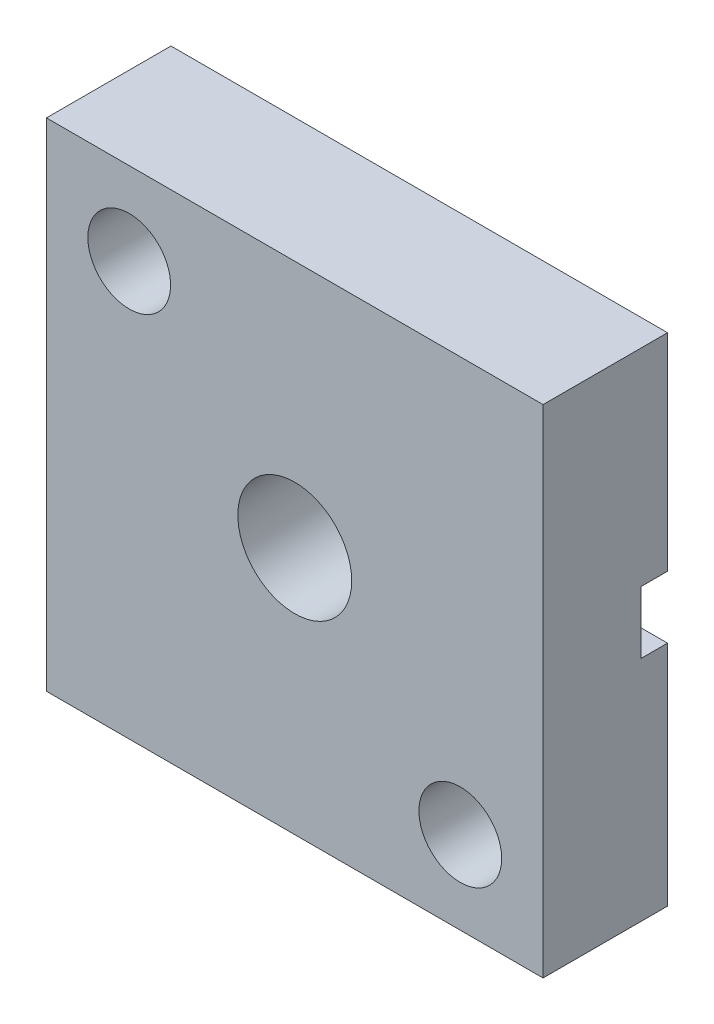
ISO-10303-21;
HEADER;
FILE_DESCRIPTION(('STEP AP214'),'2;1');
FILE_NAME('part.step','',(''),(''),'','','');
FILE_SCHEMA(('AUTOMOTIVE_DESIGN { 1 0 10303 214 1 1 1 1 }'));
ENDSEC;
DATA;
#1=APPLICATION_CONTEXT('core data for automotive mechanical design processes');
#2=APPLICATION_PROTOCOL_DEFINITION('international standard','automotive_design',2000,#1);
#3=PRODUCT_CONTEXT('',#1,'mechanical');
#4=PRODUCT('Part','Part','',(#3));
#5=PRODUCT_RELATED_PRODUCT_CATEGORY('part','',(#4));
#6=PRODUCT_DEFINITION_FORMATION('','',#4);
#7=PRODUCT_DEFINITION_CONTEXT('part definition',#1,'design');
#8=PRODUCT_DEFINITION('design','',#6,#7);
#9=PRODUCT_DEFINITION_SHAPE('','',#8);
#10=(LENGTH_UNIT() NAMED_UNIT(*) SI_UNIT(.MILLI.,.METRE.));
#11=(NAMED_UNIT(*) PLANE_ANGLE_UNIT() SI_UNIT($,.RADIAN.));
#12=(NAMED_UNIT(*) SI_UNIT($,.STERADIAN.) SOLID_ANGLE_UNIT());
#13=UNCERTAINTY_MEASURE_WITH_UNIT(LENGTH_MEASURE(1.E-05),#10,'distance_accuracy_value','');
#14=(GEOMETRIC_REPRESENTATION_CONTEXT(3) GLOBAL_UNCERTAINTY_ASSIGNED_CONTEXT((#13)) GLOBAL_UNIT_ASSIGNED_CONTEXT((#10,
#11,#12)) REPRESENTATION_CONTEXT('',''));
#15=CARTESIAN_POINT('',(0.,0.,0.));
#16=DIRECTION('',(0.,0.,1.));
#17=DIRECTION('',(1.,0.,0.));
#18=AXIS2_PLACEMENT_3D('',#15,#16,#17);
#19=CARTESIAN_POINT('',(-141.382958107723,-76.1974665146765,0.));
#20=DIRECTION('',(0.,0.,-1.));
#21=DIRECTION('',(-1.,0.,0.));
#22=AXIS2_PLACEMENT_3D('',#19,#20,#21);
#23=PLANE('',#22);
#24=DIRECTION('',(-1.,0.,0.));
#25=VECTOR('',#24,1.);
#26=CARTESIAN_POINT('',(-122.332958107723,-86.5098665146765,0.));
#27=LINE('',#26,#25);
#28=CARTESIAN_POINT('',(-122.332958107723,-86.5098665146765,0.));
#29=VERTEX_POINT('',#28);
#30=CARTESIAN_POINT('',(-129.820409433458,-86.5098665146765,0.));
#31=VERTEX_POINT('',#30);
#32=EDGE_CURVE('E152',#29,#31,#27,.T.);
#33=ORIENTED_EDGE('',*,*,#32,.F.);
#34=DIRECTION('',(0.,1.,0.));
#35=VECTOR('',#34,1.);
#36=CARTESIAN_POINT('',(-122.332958107723,-95.2474665146765,0.));
#37=LINE('',#36,#35);
#38=CARTESIAN_POINT('',(-122.332958107723,-95.2474665146765,0.));
#39=VERTEX_POINT('',#38);
#40=EDGE_CURVE('E141',#39,#29,#37,.T.);
#41=ORIENTED_EDGE('',*,*,#40,.F.);
#42=DIRECTION('',(1.,0.,0.));
#43=VECTOR('',#42,1.);
#44=CARTESIAN_POINT('',(-141.382958107723,-95.2474665146765,0.));
#45=LINE('',#44,#43);
#46=CARTESIAN_POINT('',(-141.382958107723,-95.2474665146765,0.));
#47=VERTEX_POINT('',#46);
#48=EDGE_CURVE('E194',#47,#39,#45,.T.);
#49=ORIENTED_EDGE('',*,*,#48,.F.);
#50=DIRECTION('',(0.,-1.,0.));
#51=VECTOR('',#50,1.);
#52=CARTESIAN_POINT('',(-141.382958107723,-95.2474665146765,0.));
#53=LINE('',#52,#51);
#54=CARTESIAN_POINT('',(-141.382958107723,-86.5098665146765,0.));
#55=VERTEX_POINT('',#54);
#56=EDGE_CURVE('E176',#55,#47,#53,.T.);
#57=ORIENTED_EDGE('',*,*,#56,.F.);
#58=CARTESIAN_POINT('',(-133.895506781988,-86.5098665146765,0.));
#59=VERTEX_POINT('',#58);
#60=EDGE_CURVE('E155',#59,#55,#27,.T.);
#61=ORIENTED_EDGE('',*,*,#60,.F.);
#62=CARTESIAN_POINT('',(-131.857958107723,-85.7224665146766,0.));
#63=DIRECTION('',(0.,0.,1.));
#64=DIRECTION('',(1.,0.,0.));
#65=AXIS2_PLACEMENT_3D('',#62,#63,#64);
#66=CIRCLE('',#65,2.1844);
#67=EDGE_CURVE('E177',#59,#31,#66,.T.);
#68=ORIENTED_EDGE('',*,*,#67,.T.);
#69=EDGE_LOOP('',(#33,#41,#49,#57,#61,#68));
#70=FACE_BOUND('',#69,.T.);
#71=CARTESIAN_POINT('',(-125.507958107723,-92.0724665146765,0.));
#72=DIRECTION('',(0.,0.,1.));
#73=DIRECTION('',(1.,0.,0.));
#74=AXIS2_PLACEMENT_3D('',#71,#72,#73);
#75=CIRCLE('',#74,1.5875);
#76=CARTESIAN_POINT('',(-123.920458107723,-92.0724665146765,0.));
#77=VERTEX_POINT('',#76);
#78=EDGE_CURVE('E167',#77,#77,#75,.T.);
#79=ORIENTED_EDGE('',*,*,#78,.T.);
#80=EDGE_LOOP('',(#79));
#81=FACE_BOUND('',#80,.T.);
#82=ADVANCED_FACE('F31',(#70,#81),#23,.T.);
#83=CARTESIAN_POINT('',(-141.382958107723,-95.2474665146765,4.7752));
#84=DIRECTION('',(1.,0.,0.));
#85=DIRECTION('',(0.,0.,-1.));
#86=AXIS2_PLACEMENT_3D('',#83,#84,#85);
#87=PLANE('',#86);
#88=DIRECTION('',(0.,1.,0.));
#89=VECTOR('',#88,1.);
#90=CARTESIAN_POINT('',(-141.382958107723,-84.1222665146765,1.016));
#91=LINE('',#90,#89);
#92=CARTESIAN_POINT('',(-141.382958107723,-86.5098665146765,1.016));
#93=VERTEX_POINT('',#92);
#94=CARTESIAN_POINT('',(-141.382958107723,-84.1222665146765,1.016));
#95=VERTEX_POINT('',#94);
#96=EDGE_CURVE('E144',#93,#95,#91,.T.);
#97=ORIENTED_EDGE('',*,*,#96,.F.);
#98=DIRECTION('',(0.,0.,1.));
#99=VECTOR('',#98,1.);
#100=CARTESIAN_POINT('',(-141.382958107723,-86.5098665146765,0.));
#101=LINE('',#100,#99);
#102=EDGE_CURVE('E148',#55,#93,#101,.T.);
#103=ORIENTED_EDGE('',*,*,#102,.F.);
#104=ORIENTED_EDGE('',*,*,#56,.T.);
#105=DIRECTION('',(0.,0.,-1.));
#106=VECTOR('',#105,1.);
#107=CARTESIAN_POINT('',(-141.382958107723,-95.2474665146765,4.7752));
#108=LINE('',#107,#106);
#109=CARTESIAN_POINT('',(-141.382958107723,-95.2474665146765,4.7752));
#110=VERTEX_POINT('',#109);
#111=EDGE_CURVE('E206',#110,#47,#108,.T.);
#112=ORIENTED_EDGE('',*,*,#111,.F.);
#113=DIRECTION('',(0.,-1.,0.));
#114=VECTOR('',#113,1.);
#115=CARTESIAN_POINT('',(-141.382958107723,-95.2474665146765,4.7752));
#116=LINE('',#115,#114);
#117=CARTESIAN_POINT('',(-141.382958107723,-76.1974665146765,4.7752));
#118=VERTEX_POINT('',#117);
#119=EDGE_CURVE('E180',#118,#110,#116,.T.);
#120=ORIENTED_EDGE('',*,*,#119,.F.);
#121=DIRECTION('',(0.,0.,-1.));
#122=VECTOR('',#121,1.);
#123=CARTESIAN_POINT('',(-141.382958107723,-76.1974665146765,4.7752));
#124=LINE('',#123,#122);
#125=CARTESIAN_POINT('',(-141.382958107723,-76.1974665146765,0.));
#126=VERTEX_POINT('',#125);
#127=EDGE_CURVE('E190',#118,#126,#124,.T.);
#128=ORIENTED_EDGE('',*,*,#127,.T.);
#129=CARTESIAN_POINT('',(-141.382958107723,-84.1222665146765,0.));
#130=VERTEX_POINT('',#129);
#131=EDGE_CURVE('E191',#126,#130,#53,.T.);
#132=ORIENTED_EDGE('',*,*,#131,.T.);
#133=DIRECTION('',(0.,0.,-1.));
#134=VECTOR('',#133,1.);
#135=CARTESIAN_POINT('',(-141.382958107723,-84.1222665146765,0.));
#136=LINE('',#135,#134);
#137=EDGE_CURVE('E142',#95,#130,#136,.T.);
#138=ORIENTED_EDGE('',*,*,#137,.F.);
#139=EDGE_LOOP('',(#97,#103,#104,#112,#120,#128,#132,#138));
#140=FACE_BOUND('',#139,.T.);
#141=ADVANCED_FACE('F33',(#140),#87,.F.);
#142=CARTESIAN_POINT('',(-141.382958107723,-95.2474665146765,4.7752));
#143=DIRECTION('',(0.,1.,0.));
#144=DIRECTION('',(0.,0.,1.));
#145=AXIS2_PLACEMENT_3D('',#142,#143,#144);
#146=PLANE('',#145);
#147=ORIENTED_EDGE('',*,*,#48,.T.);
#148=DIRECTION('',(0.,0.,-1.));
#149=VECTOR('',#148,1.);
#150=CARTESIAN_POINT('',(-122.332958107723,-95.2474665146765,4.7752));
#151=LINE('',#150,#149);
#152=CARTESIAN_POINT('',(-122.332958107723,-95.2474665146765,4.7752));
#153=VERTEX_POINT('',#152);
#154=EDGE_CURVE('E204',#153,#39,#151,.T.);
#155=ORIENTED_EDGE('',*,*,#154,.F.);
#156=DIRECTION('',(1.,0.,0.));
#157=VECTOR('',#156,1.);
#158=CARTESIAN_POINT('',(-141.382958107723,-95.2474665146765,4.7752));
#159=LINE('',#158,#157);
#160=EDGE_CURVE('E183',#110,#153,#159,.T.);
#161=ORIENTED_EDGE('',*,*,#160,.F.);
#162=ORIENTED_EDGE('',*,*,#111,.T.);
#163=EDGE_LOOP('',(#147,#155,#161,#162));
#164=FACE_BOUND('',#163,.T.);
#165=ADVANCED_FACE('F259',(#164),#146,.F.);
#166=CARTESIAN_POINT('',(-122.332958107723,-95.2474665146765,4.7752));
#167=DIRECTION('',(-1.,0.,0.));
#168=DIRECTION('',(0.,0.,1.));
#169=AXIS2_PLACEMENT_3D('',#166,#167,#168);
#170=PLANE('',#169);
#171=ORIENTED_EDGE('',*,*,#40,.T.);
#172=DIRECTION('',(0.,0.,1.));
#173=VECTOR('',#172,1.);
#174=CARTESIAN_POINT('',(-122.332958107723,-86.5098665146765,0.));
#175=LINE('',#174,#173);
#176=CARTESIAN_POINT('',(-122.332958107723,-86.5098665146765,1.016));
#177=VERTEX_POINT('',#176);
#178=EDGE_CURVE('E120',#29,#177,#175,.T.);
#179=ORIENTED_EDGE('',*,*,#178,.T.);
#180=DIRECTION('',(0.,1.,0.));
#181=VECTOR('',#180,1.);
#182=CARTESIAN_POINT('',(-122.332958107723,-84.1222665146765,1.016));
#183=LINE('',#182,#181);
#184=CARTESIAN_POINT('',(-122.332958107723,-84.1222665146765,1.016));
#185=VERTEX_POINT('',#184);
#186=EDGE_CURVE('E128',#177,#185,#183,.T.);
#187=ORIENTED_EDGE('',*,*,#186,.T.);
#188=DIRECTION('',(0.,0.,-1.));
#189=VECTOR('',#188,1.);
#190=CARTESIAN_POINT('',(-122.332958107723,-84.1222665146765,0.));
#191=LINE('',#190,#189);
#192=CARTESIAN_POINT('',(-122.332958107723,-84.1222665146765,0.));
#193=VERTEX_POINT('',#192);
#194=EDGE_CURVE('E135',#185,#193,#191,.T.);
#195=ORIENTED_EDGE('',*,*,#194,.T.);
#196=CARTESIAN_POINT('',(-122.332958107723,-76.1974665146765,0.));
#197=VERTEX_POINT('',#196);
#198=EDGE_CURVE('E196',#193,#197,#37,.T.);
#199=ORIENTED_EDGE('',*,*,#198,.T.);
#200=DIRECTION('',(0.,0.,-1.));
#201=VECTOR('',#200,1.);
#202=CARTESIAN_POINT('',(-122.332958107723,-76.1974665146765,4.7752));
#203=LINE('',#202,#201);
#204=CARTESIAN_POINT('',(-122.332958107723,-76.1974665146765,4.7752));
#205=VERTEX_POINT('',#204);
#206=EDGE_CURVE('E201',#205,#197,#203,.T.);
#207=ORIENTED_EDGE('',*,*,#206,.F.);
#208=DIRECTION('',(0.,1.,0.));
#209=VECTOR('',#208,1.);
#210=CARTESIAN_POINT('',(-122.332958107723,-95.2474665146765,4.7752));
#211=LINE('',#210,#209);
#212=EDGE_CURVE('E186',#153,#205,#211,.T.);
#213=ORIENTED_EDGE('',*,*,#212,.F.);
#214=ORIENTED_EDGE('',*,*,#154,.T.);
#215=EDGE_LOOP('',(#171,#179,#187,#195,#199,#207,#213,#214));
#216=FACE_BOUND('',#215,.T.);
#217=ADVANCED_FACE('F138',(#216),#170,.F.);
#218=CARTESIAN_POINT('',(-141.382958107723,-76.1974665146765,4.7752));
#219=DIRECTION('',(0.,-1.,0.));
#220=DIRECTION('',(0.,0.,-1.));
#221=AXIS2_PLACEMENT_3D('',#218,#219,#220);
#222=PLANE('',#221);
#223=DIRECTION('',(-1.,0.,0.));
#224=VECTOR('',#223,1.);
#225=CARTESIAN_POINT('',(-141.382958107723,-76.1974665146765,0.));
#226=LINE('',#225,#224);
#227=EDGE_CURVE('E184',#197,#126,#226,.T.);
#228=ORIENTED_EDGE('',*,*,#227,.T.);
#229=ORIENTED_EDGE('',*,*,#127,.F.);
#230=DIRECTION('',(-1.,0.,0.));
#231=VECTOR('',#230,1.);
#232=CARTESIAN_POINT('',(-141.382958107723,-76.1974665146765,4.7752));
#233=LINE('',#232,#231);
#234=EDGE_CURVE('E188',#205,#118,#233,.T.);
#235=ORIENTED_EDGE('',*,*,#234,.F.);
#236=ORIENTED_EDGE('',*,*,#206,.T.);
#237=EDGE_LOOP('',(#228,#229,#235,#236));
#238=FACE_BOUND('',#237,.T.);
#239=ADVANCED_FACE('F246',(#238),#222,.F.);
#240=CARTESIAN_POINT('',(-141.382958107723,-76.1974665146765,4.7752));
#241=DIRECTION('',(0.,0.,-1.));
#242=DIRECTION('',(-1.,0.,0.));
#243=AXIS2_PLACEMENT_3D('',#240,#241,#242);
#244=PLANE('',#243);
#245=CARTESIAN_POINT('',(-138.207958107723,-79.3724665146765,4.7752));
#246=DIRECTION('',(0.,0.,1.));
#247=DIRECTION('',(-1.,0.,0.));
#248=AXIS2_PLACEMENT_3D('',#245,#246,#247);
#249=CIRCLE('',#248,1.58750000000002);
#250=CARTESIAN_POINT('',(-139.795458107723,-79.3724665146765,4.7752));
#251=VERTEX_POINT('',#250);
#252=EDGE_CURVE('E154',#251,#251,#249,.T.);
#253=ORIENTED_EDGE('',*,*,#252,.F.);
#254=EDGE_LOOP('',(#253));
#255=FACE_BOUND('',#254,.T.);
#256=CARTESIAN_POINT('',(-125.507958107723,-92.0724665146765,4.7752));
#257=DIRECTION('',(0.,0.,1.));
#258=DIRECTION('',(1.,0.,0.));
#259=AXIS2_PLACEMENT_3D('',#256,#257,#258);
#260=CIRCLE('',#259,1.5875);
#261=CARTESIAN_POINT('',(-123.920458107723,-92.0724665146765,4.7752));
#262=VERTEX_POINT('',#261);
#263=EDGE_CURVE('E164',#262,#262,#260,.T.);
#264=ORIENTED_EDGE('',*,*,#263,.F.);
#265=EDGE_LOOP('',(#264));
#266=FACE_BOUND('',#265,.T.);
#267=CARTESIAN_POINT('',(-131.857958107723,-85.7224665146766,4.7752));
#268=DIRECTION('',(0.,0.,1.));
#269=DIRECTION('',(1.,0.,0.));
#270=AXIS2_PLACEMENT_3D('',#267,#268,#269);
#271=CIRCLE('',#270,2.1844);
#272=CARTESIAN_POINT('',(-129.673558107723,-85.7224665146766,4.7752));
#273=VERTEX_POINT('',#272);
#274=EDGE_CURVE('E170',#273,#273,#271,.T.);
#275=ORIENTED_EDGE('',*,*,#274,.F.);
#276=EDGE_LOOP('',(#275));
#277=FACE_BOUND('',#276,.T.);
#278=ORIENTED_EDGE('',*,*,#119,.T.);
#279=ORIENTED_EDGE('',*,*,#160,.T.);
#280=ORIENTED_EDGE('',*,*,#212,.T.);
#281=ORIENTED_EDGE('',*,*,#234,.T.);
#282=EDGE_LOOP('',(#278,#279,#280,#281));
#283=FACE_BOUND('',#282,.T.);
#284=ADVANCED_FACE('F251',(#255,#266,#277,#283),#244,.F.);
#285=DIRECTION('',(-1.,0.,0.));
#286=VECTOR('',#285,1.);
#287=CARTESIAN_POINT('',(-122.332958107723,-84.1222665146765,0.));
#288=LINE('',#287,#286);
#289=CARTESIAN_POINT('',(-133.344888946733,-84.1222665146765,0.));
#290=VERTEX_POINT('',#289);
#291=EDGE_CURVE('E159',#290,#130,#288,.T.);
#292=ORIENTED_EDGE('',*,*,#291,.T.);
#293=ORIENTED_EDGE('',*,*,#131,.F.);
#294=ORIENTED_EDGE('',*,*,#227,.F.);
#295=ORIENTED_EDGE('',*,*,#198,.F.);
#296=CARTESIAN_POINT('',(-130.371027268713,-84.1222665146765,0.));
#297=VERTEX_POINT('',#296);
#298=EDGE_CURVE('E156',#193,#297,#288,.T.);
#299=ORIENTED_EDGE('',*,*,#298,.T.);
#300=EDGE_CURVE('E173',#297,#290,#66,.T.);
#301=ORIENTED_EDGE('',*,*,#300,.T.);
#302=EDGE_LOOP('',(#292,#293,#294,#295,#299,#301));
#303=FACE_BOUND('',#302,.T.);
#304=CARTESIAN_POINT('',(-138.207958107723,-79.3724665146765,0.));
#305=DIRECTION('',(0.,0.,1.));
#306=DIRECTION('',(-1.,0.,0.));
#307=AXIS2_PLACEMENT_3D('',#304,#305,#306);
#308=CIRCLE('',#307,1.58750000000002);
#309=CARTESIAN_POINT('',(-139.795458107723,-79.3724665146765,0.));
#310=VERTEX_POINT('',#309);
#311=EDGE_CURVE('E161',#310,#310,#308,.T.);
#312=ORIENTED_EDGE('',*,*,#311,.T.);
#313=EDGE_LOOP('',(#312));
#314=FACE_BOUND('',#313,.T.);
#315=ADVANCED_FACE('F237',(#303,#314),#23,.T.);
#316=CARTESIAN_POINT('',(-131.857958107723,-85.7224665146766,0.));
#317=DIRECTION('',(0.,0.,1.));
#318=DIRECTION('',(1.,0.,0.));
#319=AXIS2_PLACEMENT_3D('',#316,#317,#318);
#320=CYLINDRICAL_SURFACE('',#319,2.1844);
#321=ORIENTED_EDGE('',*,*,#67,.F.);
#322=DIRECTION('',(0.,0.,1.));
#323=VECTOR('',#322,1.);
#324=CARTESIAN_POINT('',(-133.895506781988,-86.5098665146765,0.));
#325=LINE('',#324,#323);
#326=CARTESIAN_POINT('',(-133.895506781988,-86.5098665146765,1.016));
#327=VERTEX_POINT('',#326);
#328=EDGE_CURVE('E11',#59,#327,#325,.T.);
#329=ORIENTED_EDGE('',*,*,#328,.T.);
#330=CARTESIAN_POINT('',(-131.857958107723,-85.7224665146766,1.016));
#331=DIRECTION('',(0.,0.,1.));
#332=DIRECTION('',(0.,-1.,0.));
#333=AXIS2_PLACEMENT_3D('',#330,#331,#332);
#334=CIRCLE('',#333,2.1844);
#335=CARTESIAN_POINT('',(-133.344888946733,-84.1222665146765,1.016));
#336=VERTEX_POINT('',#335);
#337=EDGE_CURVE('E212',#327,#336,#334,.F.);
#338=ORIENTED_EDGE('',*,*,#337,.T.);
#339=DIRECTION('',(0.,0.,1.));
#340=VECTOR('',#339,1.);
#341=CARTESIAN_POINT('',(-133.344888946733,-84.1222665146765,0.));
#342=LINE('',#341,#340);
#343=EDGE_CURVE('E39',#336,#290,#342,.F.);
#344=ORIENTED_EDGE('',*,*,#343,.T.);
#345=ORIENTED_EDGE('',*,*,#300,.F.);
#346=DIRECTION('',(0.,0.,1.));
#347=VECTOR('',#346,1.);
#348=CARTESIAN_POINT('',(-130.371027268713,-84.1222665146765,0.));
#349=LINE('',#348,#347);
#350=CARTESIAN_POINT('',(-130.371027268713,-84.1222665146765,1.016));
#351=VERTEX_POINT('',#350);
#352=EDGE_CURVE('E211',#297,#351,#349,.T.);
#353=ORIENTED_EDGE('',*,*,#352,.T.);
#354=CARTESIAN_POINT('',(-129.820409433458,-86.5098665146765,1.016));
#355=VERTEX_POINT('',#354);
#356=EDGE_CURVE('E209',#351,#355,#334,.F.);
#357=ORIENTED_EDGE('',*,*,#356,.T.);
#358=DIRECTION('',(0.,0.,1.));
#359=VECTOR('',#358,1.);
#360=CARTESIAN_POINT('',(-129.820409433458,-86.5098665146765,0.));
#361=LINE('',#360,#359);
#362=EDGE_CURVE('E123',#355,#31,#361,.F.);
#363=ORIENTED_EDGE('',*,*,#362,.T.);
#364=EDGE_LOOP('',(#321,#329,#338,#344,#345,#353,#357,#363));
#365=FACE_BOUND('',#364,.T.);
#366=ORIENTED_EDGE('',*,*,#274,.T.);
#367=EDGE_LOOP('',(#366));
#368=FACE_BOUND('',#367,.T.);
#369=ADVANCED_FACE('F220',(#365,#368),#320,.F.);
#370=CARTESIAN_POINT('',(-125.507958107723,-92.0724665146765,0.));
#371=DIRECTION('',(0.,0.,1.));
#372=DIRECTION('',(1.,0.,0.));
#373=AXIS2_PLACEMENT_3D('',#370,#371,#372);
#374=CYLINDRICAL_SURFACE('',#373,1.5875);
#375=ORIENTED_EDGE('',*,*,#78,.F.);
#376=EDGE_LOOP('',(#375));
#377=FACE_BOUND('',#376,.T.);
#378=ORIENTED_EDGE('',*,*,#263,.T.);
#379=EDGE_LOOP('',(#378));
#380=FACE_BOUND('',#379,.T.);
#381=ADVANCED_FACE('F277',(#377,#380),#374,.F.);
#382=CARTESIAN_POINT('',(-138.207958107723,-79.3724665146765,0.));
#383=DIRECTION('',(0.,0.,1.));
#384=DIRECTION('',(1.,0.,0.));
#385=AXIS2_PLACEMENT_3D('',#382,#383,#384);
#386=CYLINDRICAL_SURFACE('',#385,1.58750000000002);
#387=ORIENTED_EDGE('',*,*,#311,.F.);
#388=EDGE_LOOP('',(#387));
#389=FACE_BOUND('',#388,.T.);
#390=ORIENTED_EDGE('',*,*,#252,.T.);
#391=EDGE_LOOP('',(#390));
#392=FACE_BOUND('',#391,.T.);
#393=ADVANCED_FACE('F288',(#389,#392),#386,.F.);
#394=CARTESIAN_POINT('',(-122.332958107723,-84.1222665146765,1.016));
#395=DIRECTION('',(0.,0.,1.));
#396=DIRECTION('',(0.,-1.,0.));
#397=AXIS2_PLACEMENT_3D('',#394,#395,#396);
#398=PLANE('',#397);
#399=DIRECTION('',(-1.,0.,0.));
#400=VECTOR('',#399,1.);
#401=CARTESIAN_POINT('',(-122.332958107723,-84.1222665146765,1.016));
#402=LINE('',#401,#400);
#403=EDGE_CURVE('E131',#185,#351,#402,.T.);
#404=ORIENTED_EDGE('',*,*,#403,.F.);
#405=ORIENTED_EDGE('',*,*,#186,.F.);
#406=DIRECTION('',(-1.,0.,0.));
#407=VECTOR('',#406,1.);
#408=CARTESIAN_POINT('',(-122.332958107723,-86.5098665146765,1.016));
#409=LINE('',#408,#407);
#410=EDGE_CURVE('E54',#177,#355,#409,.T.);
#411=ORIENTED_EDGE('',*,*,#410,.T.);
#412=ORIENTED_EDGE('',*,*,#356,.F.);
#413=EDGE_LOOP('',(#404,#405,#411,#412));
#414=FACE_BOUND('',#413,.T.);
#415=ADVANCED_FACE('F129',(#414),#398,.F.);
#416=CARTESIAN_POINT('',(-122.332958107723,-84.1222665146765,0.));
#417=DIRECTION('',(0.,1.,0.));
#418=DIRECTION('',(0.,0.,1.));
#419=AXIS2_PLACEMENT_3D('',#416,#417,#418);
#420=PLANE('',#419);
#421=ORIENTED_EDGE('',*,*,#298,.F.);
#422=ORIENTED_EDGE('',*,*,#194,.F.);
#423=ORIENTED_EDGE('',*,*,#403,.T.);
#424=ORIENTED_EDGE('',*,*,#352,.F.);
#425=EDGE_LOOP('',(#421,#422,#423,#424));
#426=FACE_BOUND('',#425,.T.);
#427=ADVANCED_FACE('F242',(#426),#420,.F.);
#428=CARTESIAN_POINT('',(-122.332958107723,-86.5098665146765,0.));
#429=DIRECTION('',(0.,-1.,0.));
#430=DIRECTION('',(0.,0.,-1.));
#431=AXIS2_PLACEMENT_3D('',#428,#429,#430);
#432=PLANE('',#431);
#433=ORIENTED_EDGE('',*,*,#410,.F.);
#434=ORIENTED_EDGE('',*,*,#178,.F.);
#435=ORIENTED_EDGE('',*,*,#32,.T.);
#436=ORIENTED_EDGE('',*,*,#362,.F.);
#437=EDGE_LOOP('',(#433,#434,#435,#436));
#438=FACE_BOUND('',#437,.T.);
#439=ADVANCED_FACE('F118',(#438),#432,.F.);
#440=ORIENTED_EDGE('',*,*,#60,.T.);
#441=ORIENTED_EDGE('',*,*,#102,.T.);
#442=EDGE_CURVE('E125',#327,#93,#409,.T.);
#443=ORIENTED_EDGE('',*,*,#442,.F.);
#444=ORIENTED_EDGE('',*,*,#328,.F.);
#445=EDGE_LOOP('',(#440,#441,#443,#444));
#446=FACE_BOUND('',#445,.T.);
#447=ADVANCED_FACE('F225',(#446),#432,.F.);
#448=EDGE_CURVE('E46',#336,#95,#402,.T.);
#449=ORIENTED_EDGE('',*,*,#448,.T.);
#450=ORIENTED_EDGE('',*,*,#137,.T.);
#451=ORIENTED_EDGE('',*,*,#291,.F.);
#452=ORIENTED_EDGE('',*,*,#343,.F.);
#453=EDGE_LOOP('',(#449,#450,#451,#452));
#454=FACE_BOUND('',#453,.T.);
#455=ADVANCED_FACE('F235',(#454),#420,.F.);
#456=ORIENTED_EDGE('',*,*,#442,.T.);
#457=ORIENTED_EDGE('',*,*,#96,.T.);
#458=ORIENTED_EDGE('',*,*,#448,.F.);
#459=ORIENTED_EDGE('',*,*,#337,.F.);
#460=EDGE_LOOP('',(#456,#457,#458,#459));
#461=FACE_BOUND('',#460,.T.);
#462=ADVANCED_FACE('F223',(#461),#398,.F.);
#463=CLOSED_SHELL('',(#82,#141,#165,#217,#239,#284,#315,#369,#381,#393,#415,#427,#439,#447,#455,#462));
#464=MANIFOLD_SOLID_BREP('B2',#463);
#465=ADVANCED_BREP_SHAPE_REPRESENTATION('',(#18,#464),#14);
#466=SHAPE_DEFINITION_REPRESENTATION(#9,#465);
ENDSEC;
END-ISO-10303-21;
